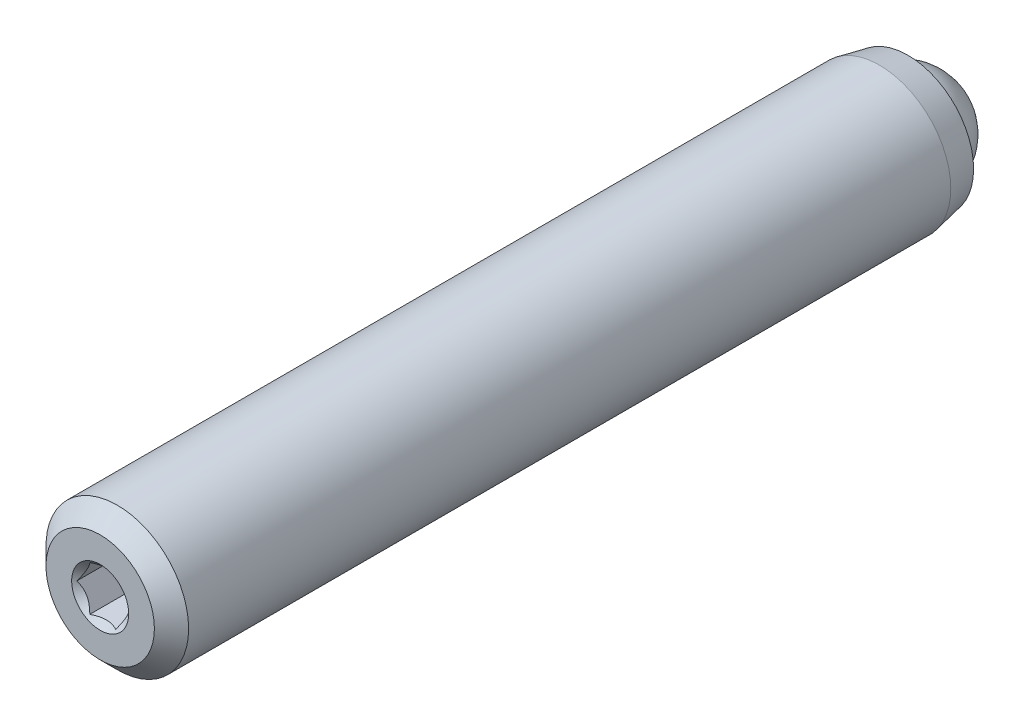
ISO-10303-21;
HEADER;
FILE_DESCRIPTION(('STEP AP214'),'2;1');
FILE_NAME('part.step','',(''),(''),'','','');
FILE_SCHEMA(('AUTOMOTIVE_DESIGN { 1 0 10303 214 1 1 1 1 }'));
ENDSEC;
DATA;
#1=APPLICATION_CONTEXT('core data for automotive mechanical design processes');
#2=APPLICATION_PROTOCOL_DEFINITION('international standard','automotive_design',2000,#1);
#3=PRODUCT_CONTEXT('',#1,'mechanical');
#4=PRODUCT('Part','Part','',(#3));
#5=PRODUCT_RELATED_PRODUCT_CATEGORY('part','',(#4));
#6=PRODUCT_DEFINITION_FORMATION('','',#4);
#7=PRODUCT_DEFINITION_CONTEXT('part definition',#1,'design');
#8=PRODUCT_DEFINITION('design','',#6,#7);
#9=PRODUCT_DEFINITION_SHAPE('','',#8);
#10=(LENGTH_UNIT() NAMED_UNIT(*) SI_UNIT(.MILLI.,.METRE.));
#11=(NAMED_UNIT(*) PLANE_ANGLE_UNIT() SI_UNIT($,.RADIAN.));
#12=(NAMED_UNIT(*) SI_UNIT($,.STERADIAN.) SOLID_ANGLE_UNIT());
#13=UNCERTAINTY_MEASURE_WITH_UNIT(LENGTH_MEASURE(1.E-05),#10,'distance_accuracy_value','');
#14=(GEOMETRIC_REPRESENTATION_CONTEXT(3) GLOBAL_UNCERTAINTY_ASSIGNED_CONTEXT((#13)) GLOBAL_UNIT_ASSIGNED_CONTEXT((#10,
#11,#12)) REPRESENTATION_CONTEXT('',''));
#15=CARTESIAN_POINT('',(0.,0.,0.));
#16=DIRECTION('',(0.,0.,1.));
#17=DIRECTION('',(1.,0.,0.));
#18=AXIS2_PLACEMENT_3D('',#15,#16,#17);
#19=CARTESIAN_POINT('',(9.74273900584421,-6.14099144723923,4.31418836824711));
#20=DIRECTION('',(0.,0.,-1.));
#21=DIRECTION('',(-1.,0.,0.));
#22=AXIS2_PLACEMENT_3D('',#19,#20,#21);
#23=PLANE('',#22);
#24=CARTESIAN_POINT('',(9.74273900584421,-6.14099144723923,4.31418836824711));
#25=DIRECTION('',(0.,0.,1.));
#26=DIRECTION('',(1.,0.,0.));
#27=AXIS2_PLACEMENT_3D('',#24,#25,#26);
#28=CIRCLE('',#27,1.27);
#29=CARTESIAN_POINT('',(11.0127390058442,-6.14099144723923,4.31418836824711));
#30=VERTEX_POINT('',#29);
#31=EDGE_CURVE('P0_E247',#30,#30,#28,.T.);
#32=ORIENTED_EDGE('',*,*,#31,.F.);
#33=EDGE_LOOP('',(#32));
#34=FACE_BOUND('',#33,.T.);
#35=CARTESIAN_POINT('',(9.74273900584421,-6.14099144723923,4.31418836824711));
#36=DIRECTION('',(0.,0.,1.));
#37=DIRECTION('',(1.,0.,0.));
#38=AXIS2_PLACEMENT_3D('',#35,#36,#37);
#39=CIRCLE('',#38,2.413);
#40=CARTESIAN_POINT('',(12.1557390058442,-6.14099144723923,4.31418836824711));
#41=VERTEX_POINT('',#40);
#42=EDGE_CURVE('P0_E162',#41,#41,#39,.T.);
#43=ORIENTED_EDGE('',*,*,#42,.T.);
#44=EDGE_LOOP('',(#43));
#45=FACE_BOUND('',#44,.T.);
#46=ADVANCED_FACE('P0_F17',(#34,#45),#23,.F.);
#47=CARTESIAN_POINT('',(9.74273900584421,-6.14099144723923,3.55218836824711));
#48=DIRECTION('',(0.,0.,-1.));
#49=DIRECTION('',(-1.,0.,0.));
#50=AXIS2_PLACEMENT_3D('',#47,#48,#49);
#51=CONICAL_SURFACE('',#50,3.175,0.785398163397448);
#52=ORIENTED_EDGE('',*,*,#42,.F.);
#53=EDGE_LOOP('',(#52));
#54=FACE_BOUND('',#53,.T.);
#55=CARTESIAN_POINT('',(9.74273900584421,-6.14099144723923,3.55218836824711));
#56=DIRECTION('',(0.,0.,1.));
#57=DIRECTION('',(1.,0.,0.));
#58=AXIS2_PLACEMENT_3D('',#55,#56,#57);
#59=CIRCLE('',#58,3.175);
#60=CARTESIAN_POINT('',(12.9177390058442,-6.14099144723923,3.55218836824711));
#61=VERTEX_POINT('',#60);
#62=EDGE_CURVE('P0_E160',#61,#61,#59,.T.);
#63=ORIENTED_EDGE('',*,*,#62,.T.);
#64=EDGE_LOOP('',(#63));
#65=FACE_BOUND('',#64,.T.);
#66=ADVANCED_FACE('P0_F311',(#54,#65),#51,.T.);
#67=CARTESIAN_POINT('',(9.74273900584421,-6.14099144723923,4.31418836824711));
#68=DIRECTION('',(0.,0.,1.));
#69=DIRECTION('',(1.,0.,0.));
#70=AXIS2_PLACEMENT_3D('',#67,#68,#69);
#71=CYLINDRICAL_SURFACE('',#70,3.175);
#72=ORIENTED_EDGE('',*,*,#62,.F.);
#73=EDGE_LOOP('',(#72));
#74=FACE_BOUND('',#73,.T.);
#75=CARTESIAN_POINT('',(9.74273900584421,-6.14099144723923,-30.3822116317529));
#76=DIRECTION('',(0.,0.,1.));
#77=DIRECTION('',(1.,0.,0.));
#78=AXIS2_PLACEMENT_3D('',#75,#76,#77);
#79=CIRCLE('',#78,3.175);
#80=CARTESIAN_POINT('',(12.9177390058442,-6.14099144723923,-30.3822116317529));
#81=VERTEX_POINT('',#80);
#82=EDGE_CURVE('P0_E157',#81,#81,#79,.T.);
#83=ORIENTED_EDGE('',*,*,#82,.T.);
#84=EDGE_LOOP('',(#83));
#85=FACE_BOUND('',#84,.T.);
#86=ADVANCED_FACE('P0_F316',(#74,#85),#71,.T.);
#87=CARTESIAN_POINT('',(9.74273900584421,-6.14099144723923,-31.6522116317529));
#88=DIRECTION('',(0.,0.,1.));
#89=DIRECTION('',(1.,0.,0.));
#90=AXIS2_PLACEMENT_3D('',#87,#88,#89);
#91=CONICAL_SURFACE('',#90,2.921,0.197395559849881);
#92=ORIENTED_EDGE('',*,*,#82,.F.);
#93=EDGE_LOOP('',(#92));
#94=FACE_BOUND('',#93,.T.);
#95=CARTESIAN_POINT('',(9.74273900584421,-6.14099144723923,-31.6522116317529));
#96=DIRECTION('',(0.,0.,1.));
#97=DIRECTION('',(1.,0.,0.));
#98=AXIS2_PLACEMENT_3D('',#95,#96,#97);
#99=CIRCLE('',#98,2.921);
#100=CARTESIAN_POINT('',(12.6637390058442,-6.14099144723923,-31.6522116317529));
#101=VERTEX_POINT('',#100);
#102=EDGE_CURVE('P0_E154',#101,#101,#99,.T.);
#103=ORIENTED_EDGE('',*,*,#102,.T.);
#104=EDGE_LOOP('',(#103));
#105=FACE_BOUND('',#104,.T.);
#106=ADVANCED_FACE('P0_F322',(#94,#105),#91,.T.);
#107=CARTESIAN_POINT('',(9.74273900584421,-3.21999144723923,-31.6522116317529));
#108=DIRECTION('',(0.,0.,1.));
#109=DIRECTION('',(1.,0.,0.));
#110=AXIS2_PLACEMENT_3D('',#107,#108,#109);
#111=PLANE('',#110);
#112=ORIENTED_EDGE('',*,*,#102,.F.);
#113=EDGE_LOOP('',(#112));
#114=FACE_BOUND('',#113,.T.);
#115=CARTESIAN_POINT('',(9.74273900584421,-6.14099144723923,-31.6522116317529));
#116=DIRECTION('',(0.,0.,1.));
#117=DIRECTION('',(1.,0.,0.));
#118=AXIS2_PLACEMENT_3D('',#115,#116,#117);
#119=CIRCLE('',#118,2.3876);
#120=CARTESIAN_POINT('',(12.1303390058442,-6.14099144723923,-31.6522116317529));
#121=VERTEX_POINT('',#120);
#122=EDGE_CURVE('P0_E151',#121,#121,#119,.T.);
#123=ORIENTED_EDGE('',*,*,#122,.T.);
#124=EDGE_LOOP('',(#123));
#125=FACE_BOUND('',#124,.T.);
#126=ADVANCED_FACE('P0_F329',(#114,#125),#111,.F.);
#127=CARTESIAN_POINT('',(9.74273900584421,-6.14099144723923,4.31418836824711));
#128=DIRECTION('',(0.,0.,1.));
#129=DIRECTION('',(1.,0.,0.));
#130=AXIS2_PLACEMENT_3D('',#127,#128,#129);
#131=CYLINDRICAL_SURFACE('',#130,2.3876);
#132=ORIENTED_EDGE('',*,*,#122,.F.);
#133=EDGE_LOOP('',(#132));
#134=FACE_BOUND('',#133,.T.);
#135=CARTESIAN_POINT('',(9.74273900584421,-6.14099144723923,-30.424565586352));
#136=DIRECTION('',(0.,0.,1.));
#137=DIRECTION('',(1.,0.,0.));
#138=AXIS2_PLACEMENT_3D('',#135,#136,#137);
#139=CIRCLE('',#138,2.3876);
#140=CARTESIAN_POINT('',(12.1303390058442,-6.14099144723923,-30.424565586352));
#141=VERTEX_POINT('',#140);
#142=EDGE_CURVE('P0_E148',#141,#141,#139,.T.);
#143=ORIENTED_EDGE('',*,*,#142,.T.);
#144=EDGE_LOOP('',(#143));
#145=FACE_BOUND('',#144,.T.);
#146=ADVANCED_FACE('P0_F333',(#134,#145),#131,.F.);
#147=CARTESIAN_POINT('',(9.74273900584421,-6.14099144723923,-28.0369655863519));
#148=DIRECTION('',(0.,0.,-1.));
#149=DIRECTION('',(-1.,0.,0.));
#150=AXIS2_PLACEMENT_3D('',#147,#148,#149);
#151=CONICAL_SURFACE('',#150,0.,0.785398163397443);
#152=ORIENTED_EDGE('',*,*,#142,.F.);
#153=EDGE_LOOP('',(#152));
#154=FACE_BOUND('',#153,.T.);
#155=CARTESIAN_POINT('',(9.74273900584421,-6.14099144723923,-28.0369655863519));
#156=VERTEX_POINT('',#155);
#157=VERTEX_LOOP('',#156);
#158=FACE_BOUND('',#157,.T.);
#159=ADVANCED_FACE('P0_F269',(#154,#158),#151,.F.);
#160=CARTESIAN_POINT('',(9.74273900584421,-6.14099144723923,3.04418836824709));
#161=DIRECTION('',(0.,0.,1.));
#162=DIRECTION('',(1.,0.,0.));
#163=AXIS2_PLACEMENT_3D('',#160,#161,#162);
#164=CONICAL_SURFACE('',#163,0.,0.785398163397443);
#165=ORIENTED_EDGE('',*,*,#31,.T.);
#166=EDGE_LOOP('',(#165));
#167=FACE_BOUND('',#166,.T.);
#168=CARTESIAN_POINT('',(10.8975550142773,-6.14079144723923,4.19900439399897));
#169=CARTESIAN_POINT('',(10.8777042137945,-6.17517404224641,4.17916683745209));
#170=CARTESIAN_POINT('',(10.8575214784036,-6.21013156537905,4.16049392726525));
#171=CARTESIAN_POINT('',(10.8163664011364,-6.28141425019532,4.12630364934952));
#172=CARTESIAN_POINT('',(10.795390141425,-6.31774619776821,4.11080531564982));
#173=CARTESIAN_POINT('',(10.7530923849422,-6.39100806104254,4.08425621376862));
#174=CARTESIAN_POINT('',(10.7317816719535,-6.42791929868464,4.07313868062328));
#175=CARTESIAN_POINT('',(10.6886912051269,-6.50255417655008,4.05600877240254));
#176=CARTESIAN_POINT('',(10.6669127684708,-6.54027553534786,4.04998360409303));
#177=CARTESIAN_POINT('',(10.6293803184842,-6.60528364565716,4.04454946159385));
#178=CARTESIAN_POINT('',(10.6136751365165,-6.6324858187674,4.04374584494309));
#179=CARTESIAN_POINT('',(10.5822951857071,-6.68683748790834,4.04509560604324));
#180=CARTESIAN_POINT('',(10.5666204243391,-6.7139869709941,4.04724963617355));
#181=CARTESIAN_POINT('',(10.5198199764436,-6.79504772456618,4.05800587875483));
#182=CARTESIAN_POINT('',(10.4889271969606,-6.84855558821765,4.07090346304171));
#183=CARTESIAN_POINT('',(10.4347071222639,-6.94246751238265,4.10202963722853));
#184=CARTESIAN_POINT('',(10.4111255631376,-6.98331197091106,4.11862670432819));
#185=CARTESIAN_POINT('',(10.3648860917779,-7.06340108462117,4.15601383131165));
#186=CARTESIAN_POINT('',(10.3422254554288,-7.10265045810967,4.17679024844376));
#187=CARTESIAN_POINT('',(10.31997380498,-7.14119144723923,4.19900439399897));
#188=B_SPLINE_CURVE_WITH_KNOTS('',3,(#168,#169,#170,#171,#172,#173,#174,#175,#176,#177,#178,
#179,#180,#181,#182,#183,#184,#185,#186,#187),.UNSPECIFIED.,.F.,.F.,(4,2,2,2,2,2,2,2,2,4),(0.,
0.133237676828557,0.267252229834487,0.399137076269296,0.530689603280762,0.62481486426384,
0.718960890149123,0.907306626112085,1.05710100361789,1.20641411519286),.UNSPECIFIED.);
#189=CARTESIAN_POINT('',(10.8974395442235,-6.14099144723923,4.19888890662636));
#190=VERTEX_POINT('',#189);
#191=CARTESIAN_POINT('',(10.3200892750338,-7.14099144723923,4.19888890662636));
#192=VERTEX_POINT('',#191);
#193=EDGE_CURVE('P0_E115',#190,#192,#188,.T.);
#194=ORIENTED_EDGE('',*,*,#193,.T.);
#195=CARTESIAN_POINT('',(8.51031050264178,-7.14099144723923,4.63128635372431));
#196=CARTESIAN_POINT('',(8.53998270076168,-7.14099144723923,4.6082484072783));
#197=CARTESIAN_POINT('',(8.56981104218133,-7.14099144723923,4.58541224539767));
#198=CARTESIAN_POINT('',(8.62984623000346,-7.14099144723923,4.54022912420729));
#199=CARTESIAN_POINT('',(8.66005316098693,-7.14099144723923,4.51788227739346));
#200=CARTESIAN_POINT('',(8.75178228815565,-7.14099144723923,4.45138534315059));
#201=CARTESIAN_POINT('',(8.81396452758707,-7.14099144723923,4.40813118503922));
#202=CARTESIAN_POINT('',(8.94491067802644,-7.14099144723923,4.32243125889816));
#203=CARTESIAN_POINT('',(9.0138370880217,-7.14099144723923,4.28023129139766));
#204=CARTESIAN_POINT('',(9.1552277602692,-7.14099144723923,4.20250206004232));
#205=CARTESIAN_POINT('',(9.2276789876563,-7.14099144723923,4.16695027043341));
#206=CARTESIAN_POINT('',(9.33568526371046,-7.14099144723923,4.12343424897431));
#207=CARTESIAN_POINT('',(9.36946583509232,-7.14099144723923,4.11109208210914));
#208=CARTESIAN_POINT('',(9.43791348520493,-7.14099144723923,4.08911273309591));
#209=CARTESIAN_POINT('',(9.47258061828307,-7.14099144723923,4.07947571721293));
#210=CARTESIAN_POINT('',(9.54196768302015,-7.14099144723923,4.06359667679777));
#211=CARTESIAN_POINT('',(9.57667273054637,-7.14099144723923,4.05729068819748));
#212=CARTESIAN_POINT('',(9.64655556321643,-7.14099144723923,4.04820649951787));
#213=CARTESIAN_POINT('',(9.68173339199748,-7.14099144723923,4.04542862737143));
#214=CARTESIAN_POINT('',(9.75049884638581,-7.14099144723923,4.04365606128879));
#215=CARTESIAN_POINT('',(9.78408198766287,-7.14099144723923,4.04448663999703));
#216=CARTESIAN_POINT('',(9.85098674621754,-7.14099144723923,4.04947664020862));
#217=CARTESIAN_POINT('',(9.88430842694802,-7.14099144723923,4.05363522712564));
#218=CARTESIAN_POINT('',(9.95103294348463,-7.14099144723923,4.06511190720631));
#219=CARTESIAN_POINT('',(9.9844257508201,-7.14099144723923,4.0724873543785));
#220=CARTESIAN_POINT('',(10.0504690645772,-7.14099144723923,4.08998167117632));
#221=CARTESIAN_POINT('',(10.0831196023826,-7.14099144723923,4.10010042457841));
#222=CARTESIAN_POINT('',(10.1825456951086,-7.14099144723923,4.13481096722407));
#223=CARTESIAN_POINT('',(10.2479876912246,-7.14099144723923,4.16320979591341));
#224=CARTESIAN_POINT('',(10.3758211422022,-7.14099144723923,4.2264268050646));
#225=CARTESIAN_POINT('',(10.4382009512613,-7.14099144723923,4.26126740155543));
#226=CARTESIAN_POINT('',(10.5574517880454,-7.14099144723923,4.33322605051449));
#227=CARTESIAN_POINT('',(10.6144428478589,-7.14099144723923,4.37014770752134));
#228=CARTESIAN_POINT('',(10.6984071950102,-7.14099144723923,4.42726054299713));
#229=CARTESIAN_POINT('',(10.7260346918042,-7.14099144723923,4.44650660504177));
#230=CARTESIAN_POINT('',(10.7809102254266,-7.14099144723923,4.48551716451218));
#231=CARTESIAN_POINT('',(10.8081583642475,-7.14099144723923,4.50528151830436));
#232=CARTESIAN_POINT('',(10.8352481880904,-7.14099144723923,4.52526105832419));
#233=B_SPLINE_CURVE_WITH_KNOTS('',3,(#195,#196,#197,#198,#199,#200,#201,#202,#203,#204,#205,
#206,#207,#208,#209,#210,#211,#212,#213,#214,#215,#216,#217,#218,#219,#220,#221,#222,#223,#224,
#225,#226,#227,#228,#229,#230,#231,#232),.UNSPECIFIED.,.F.,.F.,(4,2,2,2,2,2,2,2,2,2,2,2,2,2,2,2,
2,2,4),(0.,0.112694635133697,0.225414912901259,0.452565111221723,0.69484715433076,
0.936292788451031,1.04409719829335,1.15190823260368,1.25756594597726,1.36323347935069,
1.46384294190014,1.56442718186177,1.6668831555875,1.76933478931797,1.9827289310954,
2.19688011504817,2.40049475727374,2.50150167541717,2.60248089143825),.UNSPECIFIED.);
#234=CARTESIAN_POINT('',(9.16538873665459,-7.14099144723923,4.19888890662636));
#235=VERTEX_POINT('',#234);
#236=EDGE_CURVE('P0_E131',#192,#235,#233,.F.);
#237=ORIENTED_EDGE('',*,*,#236,.T.);
#238=CARTESIAN_POINT('',(9.16550420670843,-7.14119144723923,4.19900439399897));
#239=CARTESIAN_POINT('',(9.14565340622559,-7.10680885223205,4.17916683745209));
#240=CARTESIAN_POINT('',(9.12547067083476,-7.07185132909941,4.16049392726525));
#241=CARTESIAN_POINT('',(9.08431559356753,-7.00056864428314,4.12630364934951));
#242=CARTESIAN_POINT('',(9.06333933385613,-6.96423669671025,4.11080531564981));
#243=CARTESIAN_POINT('',(9.02104157737337,-6.89097483343592,4.08425621376862));
#244=CARTESIAN_POINT('',(8.99973086438458,-6.85406359579382,4.07313868062328));
#245=CARTESIAN_POINT('',(8.95664039755803,-6.77942871792838,4.05600877240254));
#246=CARTESIAN_POINT('',(8.93486196090194,-6.7417073591306,4.04998360409303));
#247=CARTESIAN_POINT('',(8.89732951091536,-6.6766992488213,4.04454946159385));
#248=CARTESIAN_POINT('',(8.88162432894762,-6.64949707571106,4.04374584494309));
#249=CARTESIAN_POINT('',(8.85024437813819,-6.59514540657012,4.04509560604324));
#250=CARTESIAN_POINT('',(8.83456961677027,-6.56799592348436,4.04724963617355));
#251=CARTESIAN_POINT('',(8.78776916887471,-6.48693516991228,4.05800587875482));
#252=CARTESIAN_POINT('',(8.75687638939177,-6.43342730626081,4.07090346304171));
#253=CARTESIAN_POINT('',(8.70265631469499,-6.33951538209581,4.10202963722853));
#254=CARTESIAN_POINT('',(8.67907475556871,-6.2986709235674,4.11862670432819));
#255=CARTESIAN_POINT('',(8.63283528420902,-6.21858180985729,4.15601383131165));
#256=CARTESIAN_POINT('',(8.61017464785992,-6.17933243636879,4.17679024844376));
#257=CARTESIAN_POINT('',(8.58792299741113,-6.14079144723923,4.19900439399897));
#258=B_SPLINE_CURVE_WITH_KNOTS('',3,(#238,#239,#240,#241,#242,#243,#244,#245,#246,#247,#248,
#249,#250,#251,#252,#253,#254,#255,#256,#257),.UNSPECIFIED.,.F.,.F.,(4,2,2,2,2,2,2,2,2,4),(0.,
0.133237676828558,0.267252229834487,0.399137076269296,0.530689603280762,0.624814864263839,
0.718960890149124,0.907306626112085,1.05710100361789,1.20641411519286),.UNSPECIFIED.);
#259=CARTESIAN_POINT('',(8.58803846746496,-6.14099144723923,4.19888890662636));
#260=VERTEX_POINT('',#259);
#261=EDGE_CURVE('P0_E249',#235,#260,#258,.T.);
#262=ORIENTED_EDGE('',*,*,#261,.T.);
#263=CARTESIAN_POINT('',(8.58792299741113,-6.14119144723923,4.19900439399897));
#264=CARTESIAN_POINT('',(8.60777379789396,-6.10680885223205,4.17916683745209));
#265=CARTESIAN_POINT('',(8.62795653328479,-6.07185132909941,4.16049392726525));
#266=CARTESIAN_POINT('',(8.66911161055202,-6.00056864428314,4.12630364934952));
#267=CARTESIAN_POINT('',(8.69008787026342,-5.96423669671025,4.11080531564982));
#268=CARTESIAN_POINT('',(8.73238562674618,-5.89097483343592,4.08425621376862));
#269=CARTESIAN_POINT('',(8.75369633973497,-5.85406359579382,4.07313868062328));
#270=CARTESIAN_POINT('',(8.79678680656152,-5.77942871792838,4.05600877240254));
#271=CARTESIAN_POINT('',(8.81856524321761,-5.7417073591306,4.04998360409303));
#272=CARTESIAN_POINT('',(8.8560976932042,-5.6766992488213,4.04454946159385));
#273=CARTESIAN_POINT('',(8.87180287517194,-5.64949707571106,4.04374584494309));
#274=CARTESIAN_POINT('',(8.90318282598136,-5.59514540657012,4.04509560604324));
#275=CARTESIAN_POINT('',(8.91885758734929,-5.56799592348436,4.04724963617355));
#276=CARTESIAN_POINT('',(8.96565803524484,-5.48693516991228,4.05800587875482));
#277=CARTESIAN_POINT('',(8.99655081472778,-5.43342730626081,4.07090346304171));
#278=CARTESIAN_POINT('',(9.05077088942456,-5.33951538209581,4.10202963722853));
#279=CARTESIAN_POINT('',(9.07435244855084,-5.2986709235674,4.11862670432819));
#280=CARTESIAN_POINT('',(9.12059191991053,-5.21858180985729,4.15601383131165));
#281=CARTESIAN_POINT('',(9.14325255625964,-5.17933243636879,4.17679024844376));
#282=CARTESIAN_POINT('',(9.16550420670843,-5.14079144723923,4.19900439399897));
#283=B_SPLINE_CURVE_WITH_KNOTS('',3,(#263,#264,#265,#266,#267,#268,#269,#270,#271,#272,#273,
#274,#275,#276,#277,#278,#279,#280,#281,#282),.UNSPECIFIED.,.F.,.F.,(4,2,2,2,2,2,2,2,2,4),(0.,
0.133237676828556,0.267252229834488,0.399137076269295,0.530689603280762,0.624814864263839,
0.718960890149123,0.907306626112083,1.05710100361789,1.20641411519286),.UNSPECIFIED.);
#284=CARTESIAN_POINT('',(9.16538873665459,-5.14099144723923,4.19888890662636));
#285=VERTEX_POINT('',#284);
#286=EDGE_CURVE('P0_E241',#260,#285,#283,.T.);
#287=ORIENTED_EDGE('',*,*,#286,.T.);
#288=CARTESIAN_POINT('',(8.51031050264178,-5.14099144723923,4.63128635372431));
#289=CARTESIAN_POINT('',(8.53998270076168,-5.14099144723923,4.6082484072783));
#290=CARTESIAN_POINT('',(8.56981104218133,-5.14099144723923,4.58541224539767));
#291=CARTESIAN_POINT('',(8.62984623000346,-5.14099144723923,4.54022912420729));
#292=CARTESIAN_POINT('',(8.66005316098693,-5.14099144723923,4.51788227739346));
#293=CARTESIAN_POINT('',(8.75178228815565,-5.14099144723923,4.45138534315059));
#294=CARTESIAN_POINT('',(8.81396452758707,-5.14099144723923,4.40813118503922));
#295=CARTESIAN_POINT('',(8.94491067802644,-5.14099144723923,4.32243125889816));
#296=CARTESIAN_POINT('',(9.01383708802169,-5.14099144723923,4.28023129139766));
#297=CARTESIAN_POINT('',(9.1552277602692,-5.14099144723923,4.20250206004232));
#298=CARTESIAN_POINT('',(9.2276789876563,-5.14099144723923,4.16695027043341));
#299=CARTESIAN_POINT('',(9.33568526371046,-5.14099144723923,4.12343424897431));
#300=CARTESIAN_POINT('',(9.36946583509232,-5.14099144723923,4.11109208210914));
#301=CARTESIAN_POINT('',(9.43791348520493,-5.14099144723923,4.08911273309591));
#302=CARTESIAN_POINT('',(9.47258061828307,-5.14099144723923,4.07947571721293));
#303=CARTESIAN_POINT('',(9.54196768302015,-5.14099144723923,4.06359667679777));
#304=CARTESIAN_POINT('',(9.57667273054637,-5.14099144723923,4.05729068819748));
#305=CARTESIAN_POINT('',(9.64655556321643,-5.14099144723923,4.04820649951787));
#306=CARTESIAN_POINT('',(9.68173339199748,-5.14099144723923,4.04542862737143));
#307=CARTESIAN_POINT('',(9.75049884638581,-5.14099144723923,4.04365606128879));
#308=CARTESIAN_POINT('',(9.78408198766287,-5.14099144723923,4.04448663999703));
#309=CARTESIAN_POINT('',(9.85098674621754,-5.14099144723923,4.04947664020862));
#310=CARTESIAN_POINT('',(9.88430842694802,-5.14099144723923,4.05363522712564));
#311=CARTESIAN_POINT('',(9.95103294348463,-5.14099144723923,4.06511190720631));
#312=CARTESIAN_POINT('',(9.9844257508201,-5.14099144723923,4.0724873543785));
#313=CARTESIAN_POINT('',(10.0504690645772,-5.14099144723923,4.08998167117632));
#314=CARTESIAN_POINT('',(10.0831196023826,-5.14099144723923,4.10010042457841));
#315=CARTESIAN_POINT('',(10.1825456951086,-5.14099144723923,4.13481096722407));
#316=CARTESIAN_POINT('',(10.2479876912246,-5.14099144723923,4.16320979591341));
#317=CARTESIAN_POINT('',(10.3758211422022,-5.14099144723923,4.2264268050646));
#318=CARTESIAN_POINT('',(10.4382009512613,-5.14099144723923,4.26126740155544));
#319=CARTESIAN_POINT('',(10.5574517880454,-5.14099144723923,4.3332260505145));
#320=CARTESIAN_POINT('',(10.6144428478589,-5.14099144723923,4.37014770752134));
#321=CARTESIAN_POINT('',(10.6984071950102,-5.14099144723923,4.42726054299713));
#322=CARTESIAN_POINT('',(10.7260346918042,-5.14099144723923,4.44650660504178));
#323=CARTESIAN_POINT('',(10.7809102254266,-5.14099144723923,4.48551716451218));
#324=CARTESIAN_POINT('',(10.8081583642475,-5.14099144723923,4.50528151830437));
#325=CARTESIAN_POINT('',(10.8352481880904,-5.14099144723923,4.52526105832419));
#326=B_SPLINE_CURVE_WITH_KNOTS('',3,(#288,#289,#290,#291,#292,#293,#294,#295,#296,#297,#298,
#299,#300,#301,#302,#303,#304,#305,#306,#307,#308,#309,#310,#311,#312,#313,#314,#315,#316,#317,
#318,#319,#320,#321,#322,#323,#324,#325),.UNSPECIFIED.,.F.,.F.,(4,2,2,2,2,2,2,2,2,2,2,2,2,2,2,2,
2,2,4),(0.,0.112694635133697,0.225414912901259,0.452565111221722,0.694847154330758,
0.936292788451031,1.04409719829335,1.15190823260368,1.25756594597726,1.36323347935069,
1.46384294190014,1.56442718186177,1.6668831555875,1.76933478931797,1.9827289310954,
2.19688011504817,2.40049475727374,2.50150167541718,2.60248089143825),.UNSPECIFIED.);
#327=CARTESIAN_POINT('',(10.3200892750338,-5.14099144723923,4.19888890662636));
#328=VERTEX_POINT('',#327);
#329=EDGE_CURVE('P0_E36',#285,#328,#326,.T.);
#330=ORIENTED_EDGE('',*,*,#329,.T.);
#331=CARTESIAN_POINT('',(10.31997380498,-5.14079144723923,4.19900439399897));
#332=CARTESIAN_POINT('',(10.3398246054628,-5.17517404224641,4.17916683745209));
#333=CARTESIAN_POINT('',(10.3600073408537,-5.21013156537905,4.16049392726525));
#334=CARTESIAN_POINT('',(10.4011624181209,-5.28141425019532,4.12630364934952));
#335=CARTESIAN_POINT('',(10.4221386778323,-5.31774619776821,4.11080531564982));
#336=CARTESIAN_POINT('',(10.4644364343151,-5.39100806104254,4.08425621376862));
#337=CARTESIAN_POINT('',(10.4857471473038,-5.42791929868464,4.07313868062328));
#338=CARTESIAN_POINT('',(10.5288376141304,-5.50255417655008,4.05600877240254));
#339=CARTESIAN_POINT('',(10.5506160507865,-5.54027553534786,4.04998360409303));
#340=CARTESIAN_POINT('',(10.5881485007731,-5.60528364565716,4.04454946159385));
#341=CARTESIAN_POINT('',(10.6038536827408,-5.6324858187674,4.04374584494309));
#342=CARTESIAN_POINT('',(10.6352336335502,-5.68683748790833,4.04509560604324));
#343=CARTESIAN_POINT('',(10.6509083949182,-5.7139869709941,4.04724963617355));
#344=CARTESIAN_POINT('',(10.6977088428137,-5.79504772456618,4.05800587875482));
#345=CARTESIAN_POINT('',(10.7286016222967,-5.84855558821765,4.07090346304171));
#346=CARTESIAN_POINT('',(10.7828216969934,-5.94246751238265,4.10202963722853));
#347=CARTESIAN_POINT('',(10.8064032561197,-5.98331197091106,4.11862670432819));
#348=CARTESIAN_POINT('',(10.8526427274794,-6.06340108462117,4.15601383131165));
#349=CARTESIAN_POINT('',(10.8753033638285,-6.10265045810967,4.17679024844376));
#350=CARTESIAN_POINT('',(10.8975550142773,-6.14119144723923,4.19900439399897));
#351=B_SPLINE_CURVE_WITH_KNOTS('',3,(#331,#332,#333,#334,#335,#336,#337,#338,#339,#340,#341,
#342,#343,#344,#345,#346,#347,#348,#349,#350),.UNSPECIFIED.,.F.,.F.,(4,2,2,2,2,2,2,2,2,4),(0.,
0.133237676828558,0.267252229834489,0.399137076269297,0.530689603280763,0.624814864263838,
0.718960890149123,0.907306626112084,1.05710100361789,1.20641411519286),.UNSPECIFIED.);
#352=EDGE_CURVE('P0_E11',#328,#190,#351,.T.);
#353=ORIENTED_EDGE('',*,*,#352,.T.);
#354=EDGE_LOOP('',(#194,#237,#262,#287,#330,#353));
#355=FACE_BOUND('',#354,.T.);
#356=ADVANCED_FACE('P0_F114',(#167,#355),#164,.F.);
#357=CARTESIAN_POINT('',(9.74273900584421,-6.14099144723923,0.351788368247108));
#358=DIRECTION('',(0.,0.,1.));
#359=DIRECTION('',(1.,0.,0.));
#360=AXIS2_PLACEMENT_3D('',#357,#358,#359);
#361=CONICAL_SURFACE('',#360,1.0414,1.02974425867665);
#362=CARTESIAN_POINT('',(9.74273900584421,-6.14099144723923,-0.273947880408193));
#363=VERTEX_POINT('',#362);
#364=VERTEX_LOOP('',#363);
#365=FACE_BOUND('',#364,.T.);
#366=CARTESIAN_POINT('',(9.74273900584421,-6.14099144723923,0.351788368247108));
#367=DIRECTION('',(0.,0.,1.));
#368=DIRECTION('',(1.,0.,0.));
#369=AXIS2_PLACEMENT_3D('',#366,#367,#368);
#370=CIRCLE('',#369,1.0414);
#371=CARTESIAN_POINT('',(10.7841390058442,-6.14099144723923,0.351788368247108));
#372=VERTEX_POINT('',#371);
#373=EDGE_CURVE('P0_E175',#372,#372,#370,.T.);
#374=ORIENTED_EDGE('',*,*,#373,.T.);
#375=EDGE_LOOP('',(#374));
#376=FACE_BOUND('',#375,.T.);
#377=ADVANCED_FACE('P0_F268',(#365,#376),#361,.F.);
#378=CARTESIAN_POINT('',(9.74273900584421,-6.14099144723923,1.26618836824711));
#379=DIRECTION('',(0.,0.,1.));
#380=DIRECTION('',(1.,0.,0.));
#381=AXIS2_PLACEMENT_3D('',#378,#379,#380);
#382=CYLINDRICAL_SURFACE('',#381,1.0414);
#383=ORIENTED_EDGE('',*,*,#373,.F.);
#384=EDGE_LOOP('',(#383));
#385=FACE_BOUND('',#384,.T.);
#386=CARTESIAN_POINT('',(9.74273900584421,-6.14099144723923,1.26618836824711));
#387=DIRECTION('',(0.,0.,1.));
#388=DIRECTION('',(1.,0.,0.));
#389=AXIS2_PLACEMENT_3D('',#386,#387,#388);
#390=CIRCLE('',#389,1.0414);
#391=CARTESIAN_POINT('',(10.7541208336353,-5.89275615882527,1.26618836824711));
#392=VERTEX_POINT('',#391);
#393=CARTESIAN_POINT('',(10.463407985622,-5.38922673565319,1.26618836824711));
#394=VERTEX_POINT('',#393);
#395=EDGE_CURVE('P0_E169',#392,#394,#390,.T.);
#396=ORIENTED_EDGE('',*,*,#395,.T.);
#397=CARTESIAN_POINT('',(10.0334518538575,-5.14099144723923,1.26618836824711));
#398=VERTEX_POINT('',#397);
#399=EDGE_CURVE('P0_E30',#394,#398,#390,.T.);
#400=ORIENTED_EDGE('',*,*,#399,.T.);
#401=CARTESIAN_POINT('',(9.45202615783092,-5.14099144723923,1.26618836824711));
#402=VERTEX_POINT('',#401);
#403=EDGE_CURVE('P0_E176',#398,#402,#390,.T.);
#404=ORIENTED_EDGE('',*,*,#403,.T.);
#405=CARTESIAN_POINT('',(9.02207002606642,-5.3892267356532,1.26618836824711));
#406=VERTEX_POINT('',#405);
#407=EDGE_CURVE('P0_E198',#402,#406,#390,.T.);
#408=ORIENTED_EDGE('',*,*,#407,.T.);
#409=CARTESIAN_POINT('',(8.73135717805313,-5.89275615882527,1.26618836824711));
#410=VERTEX_POINT('',#409);
#411=EDGE_CURVE('P0_E182',#406,#410,#390,.T.);
#412=ORIENTED_EDGE('',*,*,#411,.T.);
#413=CARTESIAN_POINT('',(8.73135717805313,-6.3892267356532,1.26618836824711));
#414=VERTEX_POINT('',#413);
#415=EDGE_CURVE('P0_E195',#410,#414,#390,.T.);
#416=ORIENTED_EDGE('',*,*,#415,.T.);
#417=CARTESIAN_POINT('',(9.02207002606642,-6.89275615882527,1.26618836824711));
#418=VERTEX_POINT('',#417);
#419=EDGE_CURVE('P0_E185',#414,#418,#390,.T.);
#420=ORIENTED_EDGE('',*,*,#419,.T.);
#421=CARTESIAN_POINT('',(9.45202615783092,-7.14099144723923,1.26618836824711));
#422=VERTEX_POINT('',#421);
#423=EDGE_CURVE('P0_E173',#418,#422,#390,.T.);
#424=ORIENTED_EDGE('',*,*,#423,.T.);
#425=CARTESIAN_POINT('',(10.0334518538575,-7.14099144723923,1.26618836824711));
#426=VERTEX_POINT('',#425);
#427=EDGE_CURVE('P0_E183',#422,#426,#390,.T.);
#428=ORIENTED_EDGE('',*,*,#427,.T.);
#429=CARTESIAN_POINT('',(10.463407985622,-6.89275615882526,1.26618836824711));
#430=VERTEX_POINT('',#429);
#431=EDGE_CURVE('P0_E167',#426,#430,#390,.T.);
#432=ORIENTED_EDGE('',*,*,#431,.T.);
#433=CARTESIAN_POINT('',(10.7541208336353,-6.3892267356532,1.26618836824711));
#434=VERTEX_POINT('',#433);
#435=EDGE_CURVE('P0_E44',#430,#434,#390,.T.);
#436=ORIENTED_EDGE('',*,*,#435,.T.);
#437=EDGE_CURVE('P0_E164',#434,#392,#390,.T.);
#438=ORIENTED_EDGE('',*,*,#437,.T.);
#439=EDGE_LOOP('',(#396,#400,#404,#408,#412,#416,#420,#424,#428,#432,#436,#438));
#440=FACE_BOUND('',#439,.T.);
#441=ADVANCED_FACE('P0_F194',(#385,#440),#382,.F.);
#442=CARTESIAN_POINT('',(10.7841390058442,-6.14099144723923,1.26618836824711));
#443=DIRECTION('',(0.,0.,1.));
#444=DIRECTION('',(1.,0.,0.));
#445=AXIS2_PLACEMENT_3D('',#442,#443,#444);
#446=PLANE('',#445);
#447=DIRECTION('',(0.5,0.866025403784439,0.));
#448=VECTOR('',#447,1.);
#449=CARTESIAN_POINT('',(10.3200892750338,-7.14099144723923,1.26618836824711));
#450=LINE('',#449,#448);
#451=EDGE_CURVE('P0_E400',#430,#434,#450,.T.);
#452=ORIENTED_EDGE('',*,*,#451,.T.);
#453=ORIENTED_EDGE('',*,*,#435,.F.);
#454=EDGE_LOOP('',(#452,#453));
#455=FACE_BOUND('',#454,.T.);
#456=ADVANCED_FACE('P0_F356',(#455),#446,.F.);
#457=DIRECTION('',(1.,0.,0.));
#458=VECTOR('',#457,1.);
#459=CARTESIAN_POINT('',(9.16538873665459,-7.14099144723923,1.26618836824711));
#460=LINE('',#459,#458);
#461=EDGE_CURVE('P0_E143',#422,#426,#460,.T.);
#462=ORIENTED_EDGE('',*,*,#461,.T.);
#463=ORIENTED_EDGE('',*,*,#427,.F.);
#464=EDGE_LOOP('',(#462,#463));
#465=FACE_BOUND('',#464,.T.);
#466=ADVANCED_FACE('P0_F365',(#465),#446,.F.);
#467=CARTESIAN_POINT('',(9.74273900584421,-6.14099144723923,1.26618836824711));
#468=DIRECTION('',(0.,0.,1.));
#469=DIRECTION('',(1.,0.,0.));
#470=AXIS2_PLACEMENT_3D('',#467,#468,#469);
#471=PLANE('',#470);
#472=ORIENTED_EDGE('',*,*,#431,.F.);
#473=CARTESIAN_POINT('',(10.3200892750338,-7.14099144723923,1.26618836824711));
#474=VERTEX_POINT('',#473);
#475=EDGE_CURVE('P0_E145',#426,#474,#460,.T.);
#476=ORIENTED_EDGE('',*,*,#475,.T.);
#477=EDGE_CURVE('P0_E401',#474,#430,#450,.T.);
#478=ORIENTED_EDGE('',*,*,#477,.T.);
#479=EDGE_LOOP('',(#472,#476,#478));
#480=FACE_BOUND('',#479,.T.);
#481=ADVANCED_FACE('P0_F360',(#480),#471,.T.);
#482=DIRECTION('',(0.5,-0.866025403784439,0.));
#483=VECTOR('',#482,1.);
#484=CARTESIAN_POINT('',(8.58803846746496,-6.14099144723923,1.26618836824711));
#485=LINE('',#484,#483);
#486=EDGE_CURVE('P0_E227',#414,#418,#485,.T.);
#487=ORIENTED_EDGE('',*,*,#486,.T.);
#488=ORIENTED_EDGE('',*,*,#419,.F.);
#489=EDGE_LOOP('',(#487,#488));
#490=FACE_BOUND('',#489,.T.);
#491=ADVANCED_FACE('P0_F364',(#490),#446,.F.);
#492=ORIENTED_EDGE('',*,*,#423,.F.);
#493=CARTESIAN_POINT('',(9.16538873665459,-7.14099144723923,1.26618836824711));
#494=VERTEX_POINT('',#493);
#495=EDGE_CURVE('P0_E225',#418,#494,#485,.T.);
#496=ORIENTED_EDGE('',*,*,#495,.T.);
#497=EDGE_CURVE('P0_E138',#494,#422,#460,.T.);
#498=ORIENTED_EDGE('',*,*,#497,.T.);
#499=EDGE_LOOP('',(#492,#496,#498));
#500=FACE_BOUND('',#499,.T.);
#501=ADVANCED_FACE('P0_F366',(#500),#471,.T.);
#502=DIRECTION('',(-0.5,-0.866025403784439,0.));
#503=VECTOR('',#502,1.);
#504=CARTESIAN_POINT('',(9.16538873665459,-5.14099144723923,1.26618836824711));
#505=LINE('',#504,#503);
#506=EDGE_CURVE('P0_E213',#406,#410,#505,.T.);
#507=ORIENTED_EDGE('',*,*,#506,.T.);
#508=ORIENTED_EDGE('',*,*,#411,.F.);
#509=EDGE_LOOP('',(#507,#508));
#510=FACE_BOUND('',#509,.T.);
#511=ADVANCED_FACE('P0_F372',(#510),#446,.F.);
#512=ORIENTED_EDGE('',*,*,#415,.F.);
#513=CARTESIAN_POINT('',(8.58803846746496,-6.14099144723923,1.26618836824711));
#514=VERTEX_POINT('',#513);
#515=EDGE_CURVE('P0_E205',#410,#514,#505,.T.);
#516=ORIENTED_EDGE('',*,*,#515,.T.);
#517=EDGE_CURVE('P0_E208',#514,#414,#485,.T.);
#518=ORIENTED_EDGE('',*,*,#517,.T.);
#519=EDGE_LOOP('',(#512,#516,#518));
#520=FACE_BOUND('',#519,.T.);
#521=ADVANCED_FACE('P0_F204',(#520),#471,.T.);
#522=DIRECTION('',(-1.,0.,0.));
#523=VECTOR('',#522,1.);
#524=CARTESIAN_POINT('',(10.3200892750338,-5.14099144723923,1.26618836824711));
#525=LINE('',#524,#523);
#526=EDGE_CURVE('P0_E221',#398,#402,#525,.T.);
#527=ORIENTED_EDGE('',*,*,#526,.T.);
#528=ORIENTED_EDGE('',*,*,#403,.F.);
#529=EDGE_LOOP('',(#527,#528));
#530=FACE_BOUND('',#529,.T.);
#531=ADVANCED_FACE('P0_F355',(#530),#446,.F.);
#532=ORIENTED_EDGE('',*,*,#407,.F.);
#533=CARTESIAN_POINT('',(9.16538873665459,-5.14099144723923,1.26618836824711));
#534=VERTEX_POINT('',#533);
#535=EDGE_CURVE('P0_E223',#402,#534,#525,.T.);
#536=ORIENTED_EDGE('',*,*,#535,.T.);
#537=EDGE_CURVE('P0_E219',#534,#406,#505,.T.);
#538=ORIENTED_EDGE('',*,*,#537,.T.);
#539=EDGE_LOOP('',(#532,#536,#538));
#540=FACE_BOUND('',#539,.T.);
#541=ADVANCED_FACE('P0_F350',(#540),#471,.T.);
#542=ORIENTED_EDGE('',*,*,#437,.F.);
#543=CARTESIAN_POINT('',(10.8974395442235,-6.14099144723923,1.26618836824711));
#544=VERTEX_POINT('',#543);
#545=EDGE_CURVE('P0_E180',#434,#544,#450,.T.);
#546=ORIENTED_EDGE('',*,*,#545,.T.);
#547=DIRECTION('',(-0.5,0.866025403784438,0.));
#548=VECTOR('',#547,1.);
#549=CARTESIAN_POINT('',(10.8974395442235,-6.14099144723923,1.26618836824711));
#550=LINE('',#549,#548);
#551=EDGE_CURVE('P0_E136',#544,#392,#550,.T.);
#552=ORIENTED_EDGE('',*,*,#551,.T.);
#553=EDGE_LOOP('',(#542,#546,#552));
#554=FACE_BOUND('',#553,.T.);
#555=ADVANCED_FACE('P0_F299',(#554),#471,.T.);
#556=EDGE_CURVE('P0_E405',#392,#394,#550,.T.);
#557=ORIENTED_EDGE('',*,*,#556,.T.);
#558=ORIENTED_EDGE('',*,*,#395,.F.);
#559=EDGE_LOOP('',(#557,#558));
#560=FACE_BOUND('',#559,.T.);
#561=ADVANCED_FACE('P0_F348',(#560),#446,.F.);
#562=ORIENTED_EDGE('',*,*,#399,.F.);
#563=CARTESIAN_POINT('',(10.3200892750338,-5.14099144723923,1.26618836824711));
#564=VERTEX_POINT('',#563);
#565=EDGE_CURVE('P0_E404',#394,#564,#550,.T.);
#566=ORIENTED_EDGE('',*,*,#565,.T.);
#567=EDGE_CURVE('P0_E217',#564,#398,#525,.T.);
#568=ORIENTED_EDGE('',*,*,#567,.T.);
#569=EDGE_LOOP('',(#562,#566,#568));
#570=FACE_BOUND('',#569,.T.);
#571=ADVANCED_FACE('P0_F344',(#570),#471,.T.);
#572=CARTESIAN_POINT('',(10.8974395442235,-6.14099144723923,1.26618836824711));
#573=DIRECTION('',(0.866025403784438,0.5,0.));
#574=DIRECTION('',(-0.5,0.866025403784438,0.));
#575=AXIS2_PLACEMENT_3D('',#572,#573,#574);
#576=PLANE('',#575);
#577=ORIENTED_EDGE('',*,*,#352,.F.);
#578=DIRECTION('',(0.,0.,1.));
#579=VECTOR('',#578,1.);
#580=CARTESIAN_POINT('',(10.3200892750338,-5.14099144723923,1.26618836824711));
#581=LINE('',#580,#579);
#582=EDGE_CURVE('P0_E137',#564,#328,#581,.T.);
#583=ORIENTED_EDGE('',*,*,#582,.F.);
#584=ORIENTED_EDGE('',*,*,#565,.F.);
#585=ORIENTED_EDGE('',*,*,#556,.F.);
#586=ORIENTED_EDGE('',*,*,#551,.F.);
#587=DIRECTION('',(0.,0.,1.));
#588=VECTOR('',#587,1.);
#589=CARTESIAN_POINT('',(10.8974395442235,-6.14099144723923,1.26618836824711));
#590=LINE('',#589,#588);
#591=EDGE_CURVE('P0_E126',#544,#190,#590,.T.);
#592=ORIENTED_EDGE('',*,*,#591,.T.);
#593=EDGE_LOOP('',(#577,#583,#584,#585,#586,#592));
#594=FACE_BOUND('',#593,.T.);
#595=ADVANCED_FACE('P0_F133',(#594),#576,.F.);
#596=CARTESIAN_POINT('',(10.3200892750338,-5.14099144723923,1.26618836824711));
#597=DIRECTION('',(0.,1.,0.));
#598=DIRECTION('',(0.,0.,1.));
#599=AXIS2_PLACEMENT_3D('',#596,#597,#598);
#600=PLANE('',#599);
#601=ORIENTED_EDGE('',*,*,#329,.F.);
#602=DIRECTION('',(0.,0.,1.));
#603=VECTOR('',#602,1.);
#604=CARTESIAN_POINT('',(9.16538873665459,-5.14099144723923,1.26618836824711));
#605=LINE('',#604,#603);
#606=EDGE_CURVE('P0_E140',#534,#285,#605,.T.);
#607=ORIENTED_EDGE('',*,*,#606,.F.);
#608=ORIENTED_EDGE('',*,*,#535,.F.);
#609=ORIENTED_EDGE('',*,*,#526,.F.);
#610=ORIENTED_EDGE('',*,*,#567,.F.);
#611=ORIENTED_EDGE('',*,*,#582,.T.);
#612=EDGE_LOOP('',(#601,#607,#608,#609,#610,#611));
#613=FACE_BOUND('',#612,.T.);
#614=ADVANCED_FACE('P0_F244',(#613),#600,.F.);
#615=CARTESIAN_POINT('',(9.16538873665459,-5.14099144723923,1.26618836824711));
#616=DIRECTION('',(-0.866025403784439,0.5,0.));
#617=DIRECTION('',(-0.5,-0.866025403784439,0.));
#618=AXIS2_PLACEMENT_3D('',#615,#616,#617);
#619=PLANE('',#618);
#620=ORIENTED_EDGE('',*,*,#286,.F.);
#621=DIRECTION('',(0.,0.,1.));
#622=VECTOR('',#621,1.);
#623=CARTESIAN_POINT('',(8.58803846746496,-6.14099144723923,1.26618836824711));
#624=LINE('',#623,#622);
#625=EDGE_CURVE('P0_E216',#514,#260,#624,.T.);
#626=ORIENTED_EDGE('',*,*,#625,.F.);
#627=ORIENTED_EDGE('',*,*,#515,.F.);
#628=ORIENTED_EDGE('',*,*,#506,.F.);
#629=ORIENTED_EDGE('',*,*,#537,.F.);
#630=ORIENTED_EDGE('',*,*,#606,.T.);
#631=EDGE_LOOP('',(#620,#626,#627,#628,#629,#630));
#632=FACE_BOUND('',#631,.T.);
#633=ADVANCED_FACE('P0_F211',(#632),#619,.F.);
#634=CARTESIAN_POINT('',(8.58803846746496,-6.14099144723923,1.26618836824711));
#635=DIRECTION('',(-0.866025403784439,-0.5,0.));
#636=DIRECTION('',(0.5,-0.866025403784439,0.));
#637=AXIS2_PLACEMENT_3D('',#634,#635,#636);
#638=PLANE('',#637);
#639=ORIENTED_EDGE('',*,*,#261,.F.);
#640=DIRECTION('',(0.,0.,1.));
#641=VECTOR('',#640,1.);
#642=CARTESIAN_POINT('',(9.16538873665459,-7.14099144723923,1.26618836824711));
#643=LINE('',#642,#641);
#644=EDGE_CURVE('P0_E236',#494,#235,#643,.T.);
#645=ORIENTED_EDGE('',*,*,#644,.F.);
#646=ORIENTED_EDGE('',*,*,#495,.F.);
#647=ORIENTED_EDGE('',*,*,#486,.F.);
#648=ORIENTED_EDGE('',*,*,#517,.F.);
#649=ORIENTED_EDGE('',*,*,#625,.T.);
#650=EDGE_LOOP('',(#639,#645,#646,#647,#648,#649));
#651=FACE_BOUND('',#650,.T.);
#652=ADVANCED_FACE('P0_F297',(#651),#638,.F.);
#653=CARTESIAN_POINT('',(9.16538873665459,-7.14099144723923,1.26618836824711));
#654=DIRECTION('',(0.,-1.,0.));
#655=DIRECTION('',(1.,0.,0.));
#656=AXIS2_PLACEMENT_3D('',#653,#654,#655);
#657=PLANE('',#656);
#658=ORIENTED_EDGE('',*,*,#236,.F.);
#659=DIRECTION('',(0.,0.,1.));
#660=VECTOR('',#659,1.);
#661=CARTESIAN_POINT('',(10.3200892750338,-7.14099144723923,1.26618836824711));
#662=LINE('',#661,#660);
#663=EDGE_CURVE('P0_E130',#474,#192,#662,.T.);
#664=ORIENTED_EDGE('',*,*,#663,.F.);
#665=ORIENTED_EDGE('',*,*,#475,.F.);
#666=ORIENTED_EDGE('',*,*,#461,.F.);
#667=ORIENTED_EDGE('',*,*,#497,.F.);
#668=ORIENTED_EDGE('',*,*,#644,.T.);
#669=EDGE_LOOP('',(#658,#664,#665,#666,#667,#668));
#670=FACE_BOUND('',#669,.T.);
#671=ADVANCED_FACE('P0_F293',(#670),#657,.F.);
#672=CARTESIAN_POINT('',(10.3200892750338,-7.14099144723923,1.26618836824711));
#673=DIRECTION('',(0.866025403784439,-0.5,0.));
#674=DIRECTION('',(0.5,0.866025403784439,0.));
#675=AXIS2_PLACEMENT_3D('',#672,#673,#674);
#676=PLANE('',#675);
#677=ORIENTED_EDGE('',*,*,#193,.F.);
#678=ORIENTED_EDGE('',*,*,#591,.F.);
#679=ORIENTED_EDGE('',*,*,#545,.F.);
#680=ORIENTED_EDGE('',*,*,#451,.F.);
#681=ORIENTED_EDGE('',*,*,#477,.F.);
#682=ORIENTED_EDGE('',*,*,#663,.T.);
#683=EDGE_LOOP('',(#677,#678,#679,#680,#681,#682));
#684=FACE_BOUND('',#683,.T.);
#685=ADVANCED_FACE('P0_F124',(#684),#676,.F.);
#686=CLOSED_SHELL('',(#46,#66,#86,#106,#126,#146,#159,#356,#377,#441,#456,#466,#481,#491,#501,
#511,#521,#531,#541,#555,#561,#571,#595,#614,#633,#652,#671,#685));
#687=MANIFOLD_SOLID_BREP('P0_B1',#686);
#688=CARTESIAN_POINT('',(9.74273900584421,-6.14099144723923,-31.4045616317529));
#689=DIRECTION('',(0.,1.,0.));
#690=DIRECTION('',(1.,0.,0.));
#691=AXIS2_PLACEMENT_3D('',#688,#689,#690);
#692=SPHERICAL_SURFACE('',#691,2.38125);
#693=CARTESIAN_POINT('',(9.74273900584421,-6.14099144723923,-31.4045616317529));
#694=DIRECTION('',(0.,0.,-1.));
#695=DIRECTION('',(1.,0.,0.));
#696=AXIS2_PLACEMENT_3D('',#693,#694,#695);
#697=SPHERICAL_SURFACE('',#696,2.38125);
#698=CARTESIAN_POINT('',(9.74273900584421,-6.14099144723923,-31.4045616317529));
#699=DIRECTION('',(0.,0.,-1.));
#700=DIRECTION('',(1.,0.,0.));
#701=AXIS2_PLACEMENT_3D('',#698,#699,#700);
#702=CIRCLE('',#701,2.38125);
#703=CARTESIAN_POINT('',(12.1239890058442,-6.14099144723923,-31.4045616317529));
#704=VERTEX_POINT('',#703);
#705=EDGE_CURVE('P1_E9',#704,#704,#702,.T.);
#706=ORIENTED_EDGE('',*,*,#705,.T.);
#707=EDGE_LOOP('',(#706));
#708=FACE_BOUND('',#707,.T.);
#709=ADVANCED_FACE('P1_F14',(#708),#697,.T.);
#710=CARTESIAN_POINT('',(9.74273900584421,-6.14099144723923,-31.4045616317529));
#711=DIRECTION('',(0.,0.,-1.));
#712=DIRECTION('',(1.,0.,0.));
#713=AXIS2_PLACEMENT_3D('',#710,#711,#712);
#714=SPHERICAL_SURFACE('',#713,2.38125);
#715=ORIENTED_EDGE('',*,*,#705,.F.);
#716=EDGE_LOOP('',(#715));
#717=FACE_BOUND('',#716,.T.);
#718=ADVANCED_FACE('P1_F16',(#717),#714,.T.);
#719=CLOSED_SHELL('',(#709,#718));
#720=MANIFOLD_SOLID_BREP('P1_B1',#719);
#721=ADVANCED_BREP_SHAPE_REPRESENTATION('',(#18,#687,#720),#14);
#722=SHAPE_DEFINITION_REPRESENTATION(#9,#721);
ENDSEC;
END-ISO-10303-21;
